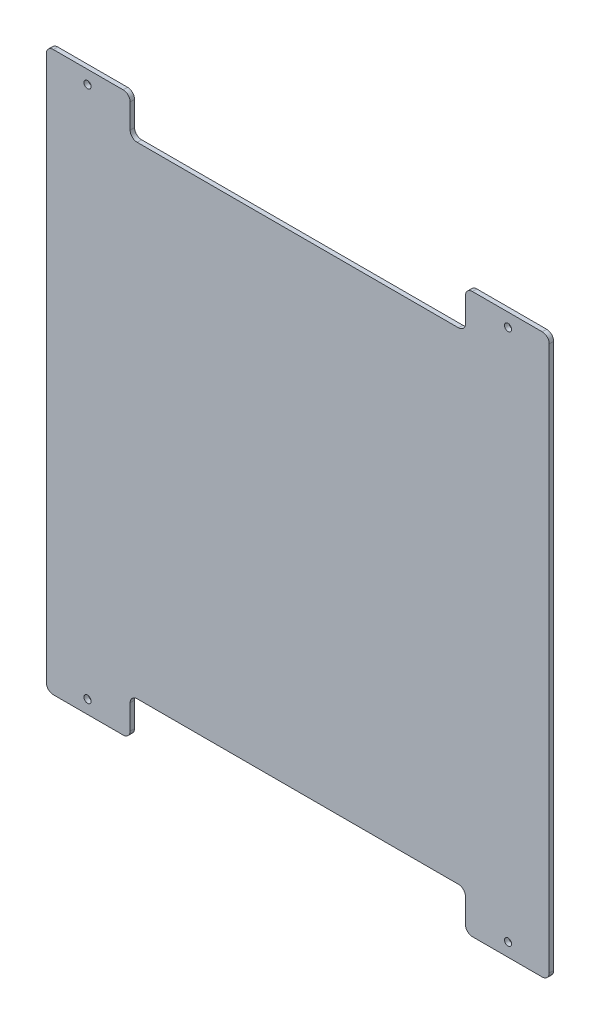
ISO-10303-21;
HEADER;
FILE_DESCRIPTION(('STEP AP214'),'2;1');
FILE_NAME('part.step','',(''),(''),'','','');
FILE_SCHEMA(('AUTOMOTIVE_DESIGN { 1 0 10303 214 1 1 1 1 }'));
ENDSEC;
DATA;
#1=APPLICATION_CONTEXT('core data for automotive mechanical design processes');
#2=APPLICATION_PROTOCOL_DEFINITION('international standard','automotive_design',2000,#1);
#3=PRODUCT_CONTEXT('',#1,'mechanical');
#4=PRODUCT('Part','Part','',(#3));
#5=PRODUCT_RELATED_PRODUCT_CATEGORY('part','',(#4));
#6=PRODUCT_DEFINITION_FORMATION('','',#4);
#7=PRODUCT_DEFINITION_CONTEXT('part definition',#1,'design');
#8=PRODUCT_DEFINITION('design','',#6,#7);
#9=PRODUCT_DEFINITION_SHAPE('','',#8);
#10=(LENGTH_UNIT() NAMED_UNIT(*) SI_UNIT(.MILLI.,.METRE.));
#11=(NAMED_UNIT(*) PLANE_ANGLE_UNIT() SI_UNIT($,.RADIAN.));
#12=(NAMED_UNIT(*) SI_UNIT($,.STERADIAN.) SOLID_ANGLE_UNIT());
#13=UNCERTAINTY_MEASURE_WITH_UNIT(LENGTH_MEASURE(1.E-05),#10,'distance_accuracy_value','');
#14=(GEOMETRIC_REPRESENTATION_CONTEXT(3) GLOBAL_UNCERTAINTY_ASSIGNED_CONTEXT((#13)) GLOBAL_UNIT_ASSIGNED_CONTEXT((#10,
#11,#12)) REPRESENTATION_CONTEXT('',''));
#15=CARTESIAN_POINT('',(0.,0.,0.));
#16=DIRECTION('',(0.,0.,1.));
#17=DIRECTION('',(1.,0.,0.));
#18=AXIS2_PLACEMENT_3D('',#15,#16,#17);
#19=CARTESIAN_POINT('',(115.,-177.5,3.175));
#20=DIRECTION('',(0.,0.,-1.));
#21=DIRECTION('',(-1.,0.,0.));
#22=AXIS2_PLACEMENT_3D('',#19,#20,#21);
#23=CYLINDRICAL_SURFACE('',#22,5.00000000000038);
#24=CARTESIAN_POINT('',(115.,-177.5,0.));
#25=DIRECTION('',(0.,0.,1.));
#26=DIRECTION('',(1.,0.,0.));
#27=AXIS2_PLACEMENT_3D('',#24,#25,#26);
#28=CIRCLE('',#27,5.00000000000038);
#29=CARTESIAN_POINT('',(120.,-177.5,0.));
#30=VERTEX_POINT('',#29);
#31=CARTESIAN_POINT('',(115.,-172.5,0.));
#32=VERTEX_POINT('',#31);
#33=EDGE_CURVE('E226',#30,#32,#28,.T.);
#34=ORIENTED_EDGE('',*,*,#33,.F.);
#35=DIRECTION('',(0.,0.,-1.));
#36=VECTOR('',#35,1.);
#37=CARTESIAN_POINT('',(120.,-177.5,3.175));
#38=LINE('',#37,#36);
#39=CARTESIAN_POINT('',(120.,-177.5,3.175));
#40=VERTEX_POINT('',#39);
#41=EDGE_CURVE('E11',#40,#30,#38,.T.);
#42=ORIENTED_EDGE('',*,*,#41,.F.);
#43=CARTESIAN_POINT('',(115.,-177.5,3.175));
#44=DIRECTION('',(0.,0.,1.));
#45=DIRECTION('',(1.,0.,0.));
#46=AXIS2_PLACEMENT_3D('',#43,#44,#45);
#47=CIRCLE('',#46,5.00000000000038);
#48=CARTESIAN_POINT('',(115.,-172.5,3.175));
#49=VERTEX_POINT('',#48);
#50=EDGE_CURVE('E290',#40,#49,#47,.T.);
#51=ORIENTED_EDGE('',*,*,#50,.T.);
#52=DIRECTION('',(0.,0.,-1.));
#53=VECTOR('',#52,1.);
#54=CARTESIAN_POINT('',(115.,-172.5,3.175));
#55=LINE('',#54,#53);
#56=EDGE_CURVE('E135',#49,#32,#55,.T.);
#57=ORIENTED_EDGE('',*,*,#56,.T.);
#58=EDGE_LOOP('',(#34,#42,#51,#57));
#59=FACE_BOUND('',#58,.T.);
#60=ADVANCED_FACE('F37',(#59),#23,.F.);
#61=CARTESIAN_POINT('',(120.,-1.90323947078601E-13,3.175));
#62=DIRECTION('',(1.,0.,0.));
#63=DIRECTION('',(0.,1.,0.));
#64=AXIS2_PLACEMENT_3D('',#61,#62,#63);
#65=PLANE('',#64);
#66=DIRECTION('',(0.,-1.,0.));
#67=VECTOR('',#66,1.);
#68=CARTESIAN_POINT('',(120.,-1.90323947078601E-13,0.));
#69=LINE('',#68,#67);
#70=CARTESIAN_POINT('',(120.,-195.,0.));
#71=VERTEX_POINT('',#70);
#72=EDGE_CURVE('E229',#30,#71,#69,.T.);
#73=ORIENTED_EDGE('',*,*,#72,.T.);
#74=DIRECTION('',(0.,0.,-1.));
#75=VECTOR('',#74,1.);
#76=CARTESIAN_POINT('',(120.,-195.,3.175));
#77=LINE('',#76,#75);
#78=CARTESIAN_POINT('',(120.,-195.,3.175));
#79=VERTEX_POINT('',#78);
#80=EDGE_CURVE('E45',#79,#71,#77,.T.);
#81=ORIENTED_EDGE('',*,*,#80,.F.);
#82=DIRECTION('',(0.,-1.,0.));
#83=VECTOR('',#82,1.);
#84=CARTESIAN_POINT('',(120.,-1.90323947078601E-13,3.175));
#85=LINE('',#84,#83);
#86=EDGE_CURVE('E357',#40,#79,#85,.T.);
#87=ORIENTED_EDGE('',*,*,#86,.F.);
#88=ORIENTED_EDGE('',*,*,#41,.T.);
#89=EDGE_LOOP('',(#73,#81,#87,#88));
#90=FACE_BOUND('',#89,.T.);
#91=ADVANCED_FACE('F462',(#90),#65,.F.);
#92=CARTESIAN_POINT('',(125.,-195.,3.175));
#93=DIRECTION('',(0.,0.,-1.));
#94=DIRECTION('',(-1.,0.,0.));
#95=AXIS2_PLACEMENT_3D('',#92,#93,#94);
#96=CYLINDRICAL_SURFACE('',#95,5.00000000000002);
#97=CARTESIAN_POINT('',(125.,-195.,0.));
#98=DIRECTION('',(0.,0.,1.));
#99=DIRECTION('',(1.,0.,0.));
#100=AXIS2_PLACEMENT_3D('',#97,#98,#99);
#101=CIRCLE('',#100,5.00000000000002);
#102=CARTESIAN_POINT('',(125.,-200.,0.));
#103=VERTEX_POINT('',#102);
#104=EDGE_CURVE('E232',#71,#103,#101,.T.);
#105=ORIENTED_EDGE('',*,*,#104,.T.);
#106=DIRECTION('',(0.,0.,-1.));
#107=VECTOR('',#106,1.);
#108=CARTESIAN_POINT('',(125.,-200.,3.175));
#109=LINE('',#108,#107);
#110=CARTESIAN_POINT('',(125.,-200.,3.175));
#111=VERTEX_POINT('',#110);
#112=EDGE_CURVE('E332',#111,#103,#109,.T.);
#113=ORIENTED_EDGE('',*,*,#112,.F.);
#114=CARTESIAN_POINT('',(125.,-195.,3.175));
#115=DIRECTION('',(0.,0.,1.));
#116=DIRECTION('',(1.,0.,0.));
#117=AXIS2_PLACEMENT_3D('',#114,#115,#116);
#118=CIRCLE('',#117,5.00000000000002);
#119=EDGE_CURVE('E340',#79,#111,#118,.T.);
#120=ORIENTED_EDGE('',*,*,#119,.F.);
#121=ORIENTED_EDGE('',*,*,#80,.T.);
#122=EDGE_LOOP('',(#105,#113,#120,#121));
#123=FACE_BOUND('',#122,.T.);
#124=ADVANCED_FACE('F338',(#123),#96,.T.);
#125=CARTESIAN_POINT('',(2.22044604925032E-13,-200.,3.175));
#126=DIRECTION('',(0.,-1.,0.));
#127=DIRECTION('',(1.,0.,0.));
#128=AXIS2_PLACEMENT_3D('',#125,#126,#127);
#129=PLANE('',#128);
#130=DIRECTION('',(-1.,0.,0.));
#131=VECTOR('',#130,1.);
#132=CARTESIAN_POINT('',(2.22044604925032E-13,-200.,0.));
#133=LINE('',#132,#131);
#134=CARTESIAN_POINT('',(175.,-200.,0.));
#135=VERTEX_POINT('',#134);
#136=EDGE_CURVE('E235',#135,#103,#133,.T.);
#137=ORIENTED_EDGE('',*,*,#136,.F.);
#138=DIRECTION('',(0.,0.,-1.));
#139=VECTOR('',#138,1.);
#140=CARTESIAN_POINT('',(175.,-200.,3.175));
#141=LINE('',#140,#139);
#142=CARTESIAN_POINT('',(175.,-200.,3.175));
#143=VERTEX_POINT('',#142);
#144=EDGE_CURVE('E330',#143,#135,#141,.T.);
#145=ORIENTED_EDGE('',*,*,#144,.F.);
#146=DIRECTION('',(-1.,0.,0.));
#147=VECTOR('',#146,1.);
#148=CARTESIAN_POINT('',(2.22044604925032E-13,-200.,3.175));
#149=LINE('',#148,#147);
#150=EDGE_CURVE('E352',#143,#111,#149,.T.);
#151=ORIENTED_EDGE('',*,*,#150,.T.);
#152=ORIENTED_EDGE('',*,*,#112,.T.);
#153=EDGE_LOOP('',(#137,#145,#151,#152));
#154=FACE_BOUND('',#153,.T.);
#155=ADVANCED_FACE('F348',(#154),#129,.T.);
#156=CARTESIAN_POINT('',(175.,-195.,3.175));
#157=DIRECTION('',(0.,0.,-1.));
#158=DIRECTION('',(-1.,0.,0.));
#159=AXIS2_PLACEMENT_3D('',#156,#157,#158);
#160=CYLINDRICAL_SURFACE('',#159,5.00000000000002);
#161=CARTESIAN_POINT('',(175.,-195.,0.));
#162=DIRECTION('',(0.,0.,1.));
#163=DIRECTION('',(1.,0.,0.));
#164=AXIS2_PLACEMENT_3D('',#161,#162,#163);
#165=CIRCLE('',#164,5.00000000000002);
#166=CARTESIAN_POINT('',(180.,-195.,0.));
#167=VERTEX_POINT('',#166);
#168=EDGE_CURVE('E238',#135,#167,#165,.T.);
#169=ORIENTED_EDGE('',*,*,#168,.T.);
#170=DIRECTION('',(0.,0.,-1.));
#171=VECTOR('',#170,1.);
#172=CARTESIAN_POINT('',(180.,-195.,3.175));
#173=LINE('',#172,#171);
#174=CARTESIAN_POINT('',(180.,-195.,3.175));
#175=VERTEX_POINT('',#174);
#176=EDGE_CURVE('E328',#175,#167,#173,.T.);
#177=ORIENTED_EDGE('',*,*,#176,.F.);
#178=CARTESIAN_POINT('',(175.,-195.,3.175));
#179=DIRECTION('',(0.,0.,1.));
#180=DIRECTION('',(1.,0.,0.));
#181=AXIS2_PLACEMENT_3D('',#178,#179,#180);
#182=CIRCLE('',#181,5.00000000000002);
#183=EDGE_CURVE('E353',#143,#175,#182,.T.);
#184=ORIENTED_EDGE('',*,*,#183,.F.);
#185=ORIENTED_EDGE('',*,*,#144,.T.);
#186=EDGE_LOOP('',(#169,#177,#184,#185));
#187=FACE_BOUND('',#186,.T.);
#188=ADVANCED_FACE('F473',(#187),#160,.T.);
#189=CARTESIAN_POINT('',(180.,0.,3.175));
#190=DIRECTION('',(1.,0.,0.));
#191=DIRECTION('',(0.,1.,0.));
#192=AXIS2_PLACEMENT_3D('',#189,#190,#191);
#193=PLANE('',#192);
#194=DIRECTION('',(0.,-1.,0.));
#195=VECTOR('',#194,1.);
#196=CARTESIAN_POINT('',(180.,0.,0.));
#197=LINE('',#196,#195);
#198=CARTESIAN_POINT('',(180.,195.,0.));
#199=VERTEX_POINT('',#198);
#200=EDGE_CURVE('E241',#199,#167,#197,.T.);
#201=ORIENTED_EDGE('',*,*,#200,.F.);
#202=DIRECTION('',(0.,0.,-1.));
#203=VECTOR('',#202,1.);
#204=CARTESIAN_POINT('',(180.,195.,3.175));
#205=LINE('',#204,#203);
#206=CARTESIAN_POINT('',(180.,195.,3.175));
#207=VERTEX_POINT('',#206);
#208=EDGE_CURVE('E326',#207,#199,#205,.T.);
#209=ORIENTED_EDGE('',*,*,#208,.F.);
#210=DIRECTION('',(0.,-1.,0.));
#211=VECTOR('',#210,1.);
#212=CARTESIAN_POINT('',(180.,0.,3.175));
#213=LINE('',#212,#211);
#214=EDGE_CURVE('E355',#207,#175,#213,.T.);
#215=ORIENTED_EDGE('',*,*,#214,.T.);
#216=ORIENTED_EDGE('',*,*,#176,.T.);
#217=EDGE_LOOP('',(#201,#209,#215,#216));
#218=FACE_BOUND('',#217,.T.);
#219=ADVANCED_FACE('F476',(#218),#193,.T.);
#220=CARTESIAN_POINT('',(175.,195.,3.175));
#221=DIRECTION('',(0.,0.,-1.));
#222=DIRECTION('',(-1.,0.,0.));
#223=AXIS2_PLACEMENT_3D('',#220,#221,#222);
#224=CYLINDRICAL_SURFACE('',#223,5.00000000000002);
#225=CARTESIAN_POINT('',(175.,195.,0.));
#226=DIRECTION('',(0.,0.,1.));
#227=DIRECTION('',(1.,0.,0.));
#228=AXIS2_PLACEMENT_3D('',#225,#226,#227);
#229=CIRCLE('',#228,5.00000000000002);
#230=CARTESIAN_POINT('',(175.,200.,0.));
#231=VERTEX_POINT('',#230);
#232=EDGE_CURVE('E244',#199,#231,#229,.T.);
#233=ORIENTED_EDGE('',*,*,#232,.T.);
#234=DIRECTION('',(0.,0.,-1.));
#235=VECTOR('',#234,1.);
#236=CARTESIAN_POINT('',(175.,200.,3.175));
#237=LINE('',#236,#235);
#238=CARTESIAN_POINT('',(175.,200.,3.175));
#239=VERTEX_POINT('',#238);
#240=EDGE_CURVE('E323',#239,#231,#237,.T.);
#241=ORIENTED_EDGE('',*,*,#240,.F.);
#242=CARTESIAN_POINT('',(175.,195.,3.175));
#243=DIRECTION('',(0.,0.,1.));
#244=DIRECTION('',(1.,0.,0.));
#245=AXIS2_PLACEMENT_3D('',#242,#243,#244);
#246=CIRCLE('',#245,5.00000000000002);
#247=EDGE_CURVE('E363',#207,#239,#246,.T.);
#248=ORIENTED_EDGE('',*,*,#247,.F.);
#249=ORIENTED_EDGE('',*,*,#208,.T.);
#250=EDGE_LOOP('',(#233,#241,#248,#249));
#251=FACE_BOUND('',#250,.T.);
#252=ADVANCED_FACE('F480',(#251),#224,.T.);
#253=CARTESIAN_POINT('',(-1.11022302462516E-13,200.,3.175));
#254=DIRECTION('',(0.,-1.,0.));
#255=DIRECTION('',(1.,0.,0.));
#256=AXIS2_PLACEMENT_3D('',#253,#254,#255);
#257=PLANE('',#256);
#258=DIRECTION('',(-1.,0.,0.));
#259=VECTOR('',#258,1.);
#260=CARTESIAN_POINT('',(-1.11022302462516E-13,200.,0.));
#261=LINE('',#260,#259);
#262=CARTESIAN_POINT('',(125.,200.,0.));
#263=VERTEX_POINT('',#262);
#264=EDGE_CURVE('E246',#231,#263,#261,.T.);
#265=ORIENTED_EDGE('',*,*,#264,.T.);
#266=DIRECTION('',(0.,0.,-1.));
#267=VECTOR('',#266,1.);
#268=CARTESIAN_POINT('',(125.,200.,3.175));
#269=LINE('',#268,#267);
#270=CARTESIAN_POINT('',(125.,200.,3.175));
#271=VERTEX_POINT('',#270);
#272=EDGE_CURVE('E321',#271,#263,#269,.T.);
#273=ORIENTED_EDGE('',*,*,#272,.F.);
#274=DIRECTION('',(-1.,0.,0.));
#275=VECTOR('',#274,1.);
#276=CARTESIAN_POINT('',(-1.11022302462516E-13,200.,3.175));
#277=LINE('',#276,#275);
#278=EDGE_CURVE('E365',#239,#271,#277,.T.);
#279=ORIENTED_EDGE('',*,*,#278,.F.);
#280=ORIENTED_EDGE('',*,*,#240,.T.);
#281=EDGE_LOOP('',(#265,#273,#279,#280));
#282=FACE_BOUND('',#281,.T.);
#283=ADVANCED_FACE('F484',(#282),#257,.F.);
#284=CARTESIAN_POINT('',(125.,195.,3.175));
#285=DIRECTION('',(0.,0.,-1.));
#286=DIRECTION('',(-1.,0.,0.));
#287=AXIS2_PLACEMENT_3D('',#284,#285,#286);
#288=CYLINDRICAL_SURFACE('',#287,5.);
#289=CARTESIAN_POINT('',(125.,195.,0.));
#290=DIRECTION('',(0.,0.,1.));
#291=DIRECTION('',(1.,0.,0.));
#292=AXIS2_PLACEMENT_3D('',#289,#290,#291);
#293=CIRCLE('',#292,5.);
#294=CARTESIAN_POINT('',(120.,195.,0.));
#295=VERTEX_POINT('',#294);
#296=EDGE_CURVE('E249',#295,#263,#293,.F.);
#297=ORIENTED_EDGE('',*,*,#296,.F.);
#298=DIRECTION('',(0.,0.,-1.));
#299=VECTOR('',#298,1.);
#300=CARTESIAN_POINT('',(120.,195.,3.175));
#301=LINE('',#300,#299);
#302=CARTESIAN_POINT('',(120.,195.,3.175));
#303=VERTEX_POINT('',#302);
#304=EDGE_CURVE('E319',#303,#295,#301,.T.);
#305=ORIENTED_EDGE('',*,*,#304,.F.);
#306=CARTESIAN_POINT('',(125.,195.,3.175));
#307=DIRECTION('',(0.,0.,1.));
#308=DIRECTION('',(1.,0.,0.));
#309=AXIS2_PLACEMENT_3D('',#306,#307,#308);
#310=CIRCLE('',#309,5.);
#311=EDGE_CURVE('E367',#303,#271,#310,.F.);
#312=ORIENTED_EDGE('',*,*,#311,.T.);
#313=ORIENTED_EDGE('',*,*,#272,.T.);
#314=EDGE_LOOP('',(#297,#305,#312,#313));
#315=FACE_BOUND('',#314,.T.);
#316=ADVANCED_FACE('F488',(#315),#288,.T.);
#317=CARTESIAN_POINT('',(120.,0.,3.175));
#318=DIRECTION('',(-1.,0.,0.));
#319=DIRECTION('',(0.,0.,1.));
#320=AXIS2_PLACEMENT_3D('',#317,#318,#319);
#321=PLANE('',#320);
#322=DIRECTION('',(0.,1.,0.));
#323=VECTOR('',#322,1.);
#324=CARTESIAN_POINT('',(120.,0.,0.));
#325=LINE('',#324,#323);
#326=CARTESIAN_POINT('',(120.,177.5,0.));
#327=VERTEX_POINT('',#326);
#328=EDGE_CURVE('E252',#327,#295,#325,.T.);
#329=ORIENTED_EDGE('',*,*,#328,.F.);
#330=DIRECTION('',(0.,0.,-1.));
#331=VECTOR('',#330,1.);
#332=CARTESIAN_POINT('',(120.,177.5,3.175));
#333=LINE('',#332,#331);
#334=CARTESIAN_POINT('',(120.,177.5,3.175));
#335=VERTEX_POINT('',#334);
#336=EDGE_CURVE('E317',#335,#327,#333,.T.);
#337=ORIENTED_EDGE('',*,*,#336,.F.);
#338=DIRECTION('',(0.,1.,0.));
#339=VECTOR('',#338,1.);
#340=CARTESIAN_POINT('',(120.,0.,3.175));
#341=LINE('',#340,#339);
#342=EDGE_CURVE('E370',#335,#303,#341,.T.);
#343=ORIENTED_EDGE('',*,*,#342,.T.);
#344=ORIENTED_EDGE('',*,*,#304,.T.);
#345=EDGE_LOOP('',(#329,#337,#343,#344));
#346=FACE_BOUND('',#345,.T.);
#347=ADVANCED_FACE('F492',(#346),#321,.T.);
#348=CARTESIAN_POINT('',(115.,177.5,3.175));
#349=DIRECTION('',(0.,0.,-1.));
#350=DIRECTION('',(-1.,0.,0.));
#351=AXIS2_PLACEMENT_3D('',#348,#349,#350);
#352=CYLINDRICAL_SURFACE('',#351,5.00000000000002);
#353=CARTESIAN_POINT('',(115.,177.5,0.));
#354=DIRECTION('',(0.,0.,1.));
#355=DIRECTION('',(1.,0.,0.));
#356=AXIS2_PLACEMENT_3D('',#353,#354,#355);
#357=CIRCLE('',#356,5.00000000000002);
#358=CARTESIAN_POINT('',(115.,172.5,0.));
#359=VERTEX_POINT('',#358);
#360=EDGE_CURVE('E255',#327,#359,#357,.F.);
#361=ORIENTED_EDGE('',*,*,#360,.T.);
#362=DIRECTION('',(0.,0.,-1.));
#363=VECTOR('',#362,1.);
#364=CARTESIAN_POINT('',(115.,172.5,3.175));
#365=LINE('',#364,#363);
#366=CARTESIAN_POINT('',(115.,172.5,3.175));
#367=VERTEX_POINT('',#366);
#368=EDGE_CURVE('E315',#367,#359,#365,.T.);
#369=ORIENTED_EDGE('',*,*,#368,.F.);
#370=CARTESIAN_POINT('',(115.,177.5,3.175));
#371=DIRECTION('',(0.,0.,1.));
#372=DIRECTION('',(1.,0.,0.));
#373=AXIS2_PLACEMENT_3D('',#370,#371,#372);
#374=CIRCLE('',#373,5.00000000000002);
#375=EDGE_CURVE('E373',#335,#367,#374,.F.);
#376=ORIENTED_EDGE('',*,*,#375,.F.);
#377=ORIENTED_EDGE('',*,*,#336,.T.);
#378=EDGE_LOOP('',(#361,#369,#376,#377));
#379=FACE_BOUND('',#378,.T.);
#380=ADVANCED_FACE('F496',(#379),#352,.F.);
#381=CARTESIAN_POINT('',(0.,172.5,3.175));
#382=DIRECTION('',(0.,1.,0.));
#383=DIRECTION('',(-1.,0.,0.));
#384=AXIS2_PLACEMENT_3D('',#381,#382,#383);
#385=PLANE('',#384);
#386=DIRECTION('',(1.,0.,0.));
#387=VECTOR('',#386,1.);
#388=CARTESIAN_POINT('',(0.,172.5,0.));
#389=LINE('',#388,#387);
#390=CARTESIAN_POINT('',(-115.,172.5,0.));
#391=VERTEX_POINT('',#390);
#392=EDGE_CURVE('E258',#391,#359,#389,.T.);
#393=ORIENTED_EDGE('',*,*,#392,.F.);
#394=DIRECTION('',(0.,0.,-1.));
#395=VECTOR('',#394,1.);
#396=CARTESIAN_POINT('',(-115.,172.5,3.175));
#397=LINE('',#396,#395);
#398=CARTESIAN_POINT('',(-115.,172.5,3.175));
#399=VERTEX_POINT('',#398);
#400=EDGE_CURVE('E313',#399,#391,#397,.T.);
#401=ORIENTED_EDGE('',*,*,#400,.F.);
#402=DIRECTION('',(1.,0.,0.));
#403=VECTOR('',#402,1.);
#404=CARTESIAN_POINT('',(0.,172.5,3.175));
#405=LINE('',#404,#403);
#406=EDGE_CURVE('E375',#399,#367,#405,.T.);
#407=ORIENTED_EDGE('',*,*,#406,.T.);
#408=ORIENTED_EDGE('',*,*,#368,.T.);
#409=EDGE_LOOP('',(#393,#401,#407,#408));
#410=FACE_BOUND('',#409,.T.);
#411=ADVANCED_FACE('F500',(#410),#385,.T.);
#412=CARTESIAN_POINT('',(-115.,177.5,3.175));
#413=DIRECTION('',(0.,0.,-1.));
#414=DIRECTION('',(-1.,0.,0.));
#415=AXIS2_PLACEMENT_3D('',#412,#413,#414);
#416=CYLINDRICAL_SURFACE('',#415,4.99999999999999);
#417=CARTESIAN_POINT('',(-115.,177.5,0.));
#418=DIRECTION('',(0.,0.,1.));
#419=DIRECTION('',(1.,0.,0.));
#420=AXIS2_PLACEMENT_3D('',#417,#418,#419);
#421=CIRCLE('',#420,4.99999999999999);
#422=CARTESIAN_POINT('',(-120.,177.5,0.));
#423=VERTEX_POINT('',#422);
#424=EDGE_CURVE('E261',#423,#391,#421,.T.);
#425=ORIENTED_EDGE('',*,*,#424,.F.);
#426=DIRECTION('',(0.,0.,-1.));
#427=VECTOR('',#426,1.);
#428=CARTESIAN_POINT('',(-120.,177.5,3.175));
#429=LINE('',#428,#427);
#430=CARTESIAN_POINT('',(-120.,177.5,3.175));
#431=VERTEX_POINT('',#430);
#432=EDGE_CURVE('E311',#431,#423,#429,.T.);
#433=ORIENTED_EDGE('',*,*,#432,.F.);
#434=CARTESIAN_POINT('',(-115.,177.5,3.175));
#435=DIRECTION('',(0.,0.,1.));
#436=DIRECTION('',(1.,0.,0.));
#437=AXIS2_PLACEMENT_3D('',#434,#435,#436);
#438=CIRCLE('',#437,4.99999999999999);
#439=EDGE_CURVE('E378',#431,#399,#438,.T.);
#440=ORIENTED_EDGE('',*,*,#439,.T.);
#441=ORIENTED_EDGE('',*,*,#400,.T.);
#442=EDGE_LOOP('',(#425,#433,#440,#441));
#443=FACE_BOUND('',#442,.T.);
#444=ADVANCED_FACE('F504',(#443),#416,.F.);
#445=CARTESIAN_POINT('',(-120.,0.,3.175));
#446=DIRECTION('',(-1.,0.,0.));
#447=DIRECTION('',(0.,0.,1.));
#448=AXIS2_PLACEMENT_3D('',#445,#446,#447);
#449=PLANE('',#448);
#450=DIRECTION('',(0.,1.,0.));
#451=VECTOR('',#450,1.);
#452=CARTESIAN_POINT('',(-120.,0.,0.));
#453=LINE('',#452,#451);
#454=CARTESIAN_POINT('',(-120.,195.,0.));
#455=VERTEX_POINT('',#454);
#456=EDGE_CURVE('E264',#423,#455,#453,.T.);
#457=ORIENTED_EDGE('',*,*,#456,.T.);
#458=DIRECTION('',(0.,0.,-1.));
#459=VECTOR('',#458,1.);
#460=CARTESIAN_POINT('',(-120.,195.,3.175));
#461=LINE('',#460,#459);
#462=CARTESIAN_POINT('',(-120.,195.,3.175));
#463=VERTEX_POINT('',#462);
#464=EDGE_CURVE('E308',#463,#455,#461,.T.);
#465=ORIENTED_EDGE('',*,*,#464,.F.);
#466=DIRECTION('',(0.,1.,0.));
#467=VECTOR('',#466,1.);
#468=CARTESIAN_POINT('',(-120.,0.,3.175));
#469=LINE('',#468,#467);
#470=EDGE_CURVE('E381',#431,#463,#469,.T.);
#471=ORIENTED_EDGE('',*,*,#470,.F.);
#472=ORIENTED_EDGE('',*,*,#432,.T.);
#473=EDGE_LOOP('',(#457,#465,#471,#472));
#474=FACE_BOUND('',#473,.T.);
#475=ADVANCED_FACE('F508',(#474),#449,.F.);
#476=CARTESIAN_POINT('',(-125.,195.,3.175));
#477=DIRECTION('',(0.,0.,-1.));
#478=DIRECTION('',(-1.,0.,0.));
#479=AXIS2_PLACEMENT_3D('',#476,#477,#478);
#480=CYLINDRICAL_SURFACE('',#479,5.00000000000001);
#481=CARTESIAN_POINT('',(-125.,195.,0.));
#482=DIRECTION('',(0.,0.,1.));
#483=DIRECTION('',(1.,0.,0.));
#484=AXIS2_PLACEMENT_3D('',#481,#482,#483);
#485=CIRCLE('',#484,5.00000000000001);
#486=CARTESIAN_POINT('',(-125.,200.,0.));
#487=VERTEX_POINT('',#486);
#488=EDGE_CURVE('E266',#455,#487,#485,.T.);
#489=ORIENTED_EDGE('',*,*,#488,.T.);
#490=DIRECTION('',(0.,0.,-1.));
#491=VECTOR('',#490,1.);
#492=CARTESIAN_POINT('',(-125.,200.,3.175));
#493=LINE('',#492,#491);
#494=CARTESIAN_POINT('',(-125.,200.,3.175));
#495=VERTEX_POINT('',#494);
#496=EDGE_CURVE('E306',#495,#487,#493,.T.);
#497=ORIENTED_EDGE('',*,*,#496,.F.);
#498=CARTESIAN_POINT('',(-125.,195.,3.175));
#499=DIRECTION('',(0.,0.,1.));
#500=DIRECTION('',(1.,0.,0.));
#501=AXIS2_PLACEMENT_3D('',#498,#499,#500);
#502=CIRCLE('',#501,5.00000000000001);
#503=EDGE_CURVE('E383',#463,#495,#502,.T.);
#504=ORIENTED_EDGE('',*,*,#503,.F.);
#505=ORIENTED_EDGE('',*,*,#464,.T.);
#506=EDGE_LOOP('',(#489,#497,#504,#505));
#507=FACE_BOUND('',#506,.T.);
#508=ADVANCED_FACE('F512',(#507),#480,.T.);
#509=CARTESIAN_POINT('',(-1.11022302462516E-13,200.,3.175));
#510=DIRECTION('',(0.,1.,0.));
#511=DIRECTION('',(-1.,0.,0.));
#512=AXIS2_PLACEMENT_3D('',#509,#510,#511);
#513=PLANE('',#512);
#514=DIRECTION('',(1.,0.,0.));
#515=VECTOR('',#514,1.);
#516=CARTESIAN_POINT('',(-1.11022302462516E-13,200.,0.));
#517=LINE('',#516,#515);
#518=CARTESIAN_POINT('',(-175.,200.,0.));
#519=VERTEX_POINT('',#518);
#520=EDGE_CURVE('E269',#519,#487,#517,.T.);
#521=ORIENTED_EDGE('',*,*,#520,.F.);
#522=DIRECTION('',(0.,0.,-1.));
#523=VECTOR('',#522,1.);
#524=CARTESIAN_POINT('',(-175.,200.,3.175));
#525=LINE('',#524,#523);
#526=CARTESIAN_POINT('',(-175.,200.,3.175));
#527=VERTEX_POINT('',#526);
#528=EDGE_CURVE('E304',#527,#519,#525,.T.);
#529=ORIENTED_EDGE('',*,*,#528,.F.);
#530=DIRECTION('',(1.,0.,0.));
#531=VECTOR('',#530,1.);
#532=CARTESIAN_POINT('',(-1.11022302462516E-13,200.,3.175));
#533=LINE('',#532,#531);
#534=EDGE_CURVE('E385',#527,#495,#533,.T.);
#535=ORIENTED_EDGE('',*,*,#534,.T.);
#536=ORIENTED_EDGE('',*,*,#496,.T.);
#537=EDGE_LOOP('',(#521,#529,#535,#536));
#538=FACE_BOUND('',#537,.T.);
#539=ADVANCED_FACE('F516',(#538),#513,.T.);
#540=CARTESIAN_POINT('',(-175.,195.,3.175));
#541=DIRECTION('',(0.,0.,-1.));
#542=DIRECTION('',(-1.,0.,0.));
#543=AXIS2_PLACEMENT_3D('',#540,#541,#542);
#544=CYLINDRICAL_SURFACE('',#543,5.00000000000002);
#545=CARTESIAN_POINT('',(-175.,195.,0.));
#546=DIRECTION('',(0.,0.,1.));
#547=DIRECTION('',(1.,0.,0.));
#548=AXIS2_PLACEMENT_3D('',#545,#546,#547);
#549=CIRCLE('',#548,5.00000000000002);
#550=CARTESIAN_POINT('',(-180.,195.,0.));
#551=VERTEX_POINT('',#550);
#552=EDGE_CURVE('E272',#519,#551,#549,.T.);
#553=ORIENTED_EDGE('',*,*,#552,.T.);
#554=DIRECTION('',(0.,0.,-1.));
#555=VECTOR('',#554,1.);
#556=CARTESIAN_POINT('',(-180.,195.,3.175));
#557=LINE('',#556,#555);
#558=CARTESIAN_POINT('',(-180.,195.,3.175));
#559=VERTEX_POINT('',#558);
#560=EDGE_CURVE('E302',#559,#551,#557,.T.);
#561=ORIENTED_EDGE('',*,*,#560,.F.);
#562=CARTESIAN_POINT('',(-175.,195.,3.175));
#563=DIRECTION('',(0.,0.,1.));
#564=DIRECTION('',(1.,0.,0.));
#565=AXIS2_PLACEMENT_3D('',#562,#563,#564);
#566=CIRCLE('',#565,5.00000000000002);
#567=EDGE_CURVE('E388',#527,#559,#566,.T.);
#568=ORIENTED_EDGE('',*,*,#567,.F.);
#569=ORIENTED_EDGE('',*,*,#528,.T.);
#570=EDGE_LOOP('',(#553,#561,#568,#569));
#571=FACE_BOUND('',#570,.T.);
#572=ADVANCED_FACE('F520',(#571),#544,.T.);
#573=CARTESIAN_POINT('',(-180.,0.,3.175));
#574=DIRECTION('',(-1.,0.,0.));
#575=DIRECTION('',(0.,-1.,0.));
#576=AXIS2_PLACEMENT_3D('',#573,#574,#575);
#577=PLANE('',#576);
#578=DIRECTION('',(0.,1.,0.));
#579=VECTOR('',#578,1.);
#580=CARTESIAN_POINT('',(-180.,0.,0.));
#581=LINE('',#580,#579);
#582=CARTESIAN_POINT('',(-180.,-195.,0.));
#583=VERTEX_POINT('',#582);
#584=EDGE_CURVE('E275',#583,#551,#581,.T.);
#585=ORIENTED_EDGE('',*,*,#584,.F.);
#586=DIRECTION('',(0.,0.,-1.));
#587=VECTOR('',#586,1.);
#588=CARTESIAN_POINT('',(-180.,-195.,3.175));
#589=LINE('',#588,#587);
#590=CARTESIAN_POINT('',(-180.,-195.,3.175));
#591=VERTEX_POINT('',#590);
#592=EDGE_CURVE('E300',#591,#583,#589,.T.);
#593=ORIENTED_EDGE('',*,*,#592,.F.);
#594=DIRECTION('',(0.,1.,0.));
#595=VECTOR('',#594,1.);
#596=CARTESIAN_POINT('',(-180.,0.,3.175));
#597=LINE('',#596,#595);
#598=EDGE_CURVE('E390',#591,#559,#597,.T.);
#599=ORIENTED_EDGE('',*,*,#598,.T.);
#600=ORIENTED_EDGE('',*,*,#560,.T.);
#601=EDGE_LOOP('',(#585,#593,#599,#600));
#602=FACE_BOUND('',#601,.T.);
#603=ADVANCED_FACE('F524',(#602),#577,.T.);
#604=CARTESIAN_POINT('',(-175.,-195.,3.175));
#605=DIRECTION('',(0.,0.,-1.));
#606=DIRECTION('',(-1.,0.,0.));
#607=AXIS2_PLACEMENT_3D('',#604,#605,#606);
#608=CYLINDRICAL_SURFACE('',#607,4.99999999999982);
#609=CARTESIAN_POINT('',(-175.,-195.,0.));
#610=DIRECTION('',(0.,0.,1.));
#611=DIRECTION('',(1.,0.,0.));
#612=AXIS2_PLACEMENT_3D('',#609,#610,#611);
#613=CIRCLE('',#612,4.99999999999982);
#614=CARTESIAN_POINT('',(-175.,-200.,0.));
#615=VERTEX_POINT('',#614);
#616=EDGE_CURVE('E278',#583,#615,#613,.T.);
#617=ORIENTED_EDGE('',*,*,#616,.T.);
#618=DIRECTION('',(0.,0.,-1.));
#619=VECTOR('',#618,1.);
#620=CARTESIAN_POINT('',(-175.,-200.,3.175));
#621=LINE('',#620,#619);
#622=CARTESIAN_POINT('',(-175.,-200.,3.175));
#623=VERTEX_POINT('',#622);
#624=EDGE_CURVE('E297',#623,#615,#621,.T.);
#625=ORIENTED_EDGE('',*,*,#624,.F.);
#626=CARTESIAN_POINT('',(-175.,-195.,3.175));
#627=DIRECTION('',(0.,0.,1.));
#628=DIRECTION('',(1.,0.,0.));
#629=AXIS2_PLACEMENT_3D('',#626,#627,#628);
#630=CIRCLE('',#629,4.99999999999982);
#631=EDGE_CURVE('E393',#591,#623,#630,.T.);
#632=ORIENTED_EDGE('',*,*,#631,.F.);
#633=ORIENTED_EDGE('',*,*,#592,.T.);
#634=EDGE_LOOP('',(#617,#625,#632,#633));
#635=FACE_BOUND('',#634,.T.);
#636=ADVANCED_FACE('F528',(#635),#608,.T.);
#637=CARTESIAN_POINT('',(-1.11022302462514E-13,-200.,3.175));
#638=DIRECTION('',(0.,1.,0.));
#639=DIRECTION('',(-1.,0.,0.));
#640=AXIS2_PLACEMENT_3D('',#637,#638,#639);
#641=PLANE('',#640);
#642=DIRECTION('',(1.,0.,0.));
#643=VECTOR('',#642,1.);
#644=CARTESIAN_POINT('',(-1.11022302462514E-13,-200.,0.));
#645=LINE('',#644,#643);
#646=CARTESIAN_POINT('',(-124.999999999999,-200.,0.));
#647=VERTEX_POINT('',#646);
#648=EDGE_CURVE('E280',#615,#647,#645,.T.);
#649=ORIENTED_EDGE('',*,*,#648,.T.);
#650=DIRECTION('',(0.,0.,-1.));
#651=VECTOR('',#650,1.);
#652=CARTESIAN_POINT('',(-124.999999999999,-200.,3.175));
#653=LINE('',#652,#651);
#654=CARTESIAN_POINT('',(-124.999999999999,-200.,3.175));
#655=VERTEX_POINT('',#654);
#656=EDGE_CURVE('E294',#655,#647,#653,.T.);
#657=ORIENTED_EDGE('',*,*,#656,.F.);
#658=DIRECTION('',(1.,0.,0.));
#659=VECTOR('',#658,1.);
#660=CARTESIAN_POINT('',(-1.11022302462514E-13,-200.,3.175));
#661=LINE('',#660,#659);
#662=EDGE_CURVE('E395',#623,#655,#661,.T.);
#663=ORIENTED_EDGE('',*,*,#662,.F.);
#664=ORIENTED_EDGE('',*,*,#624,.T.);
#665=EDGE_LOOP('',(#649,#657,#663,#664));
#666=FACE_BOUND('',#665,.T.);
#667=ADVANCED_FACE('F402',(#666),#641,.F.);
#668=CARTESIAN_POINT('',(-124.999999999999,-195.000000000001,3.175));
#669=DIRECTION('',(0.,0.,-1.));
#670=DIRECTION('',(-1.,0.,0.));
#671=AXIS2_PLACEMENT_3D('',#668,#669,#670);
#672=CYLINDRICAL_SURFACE('',#671,4.99999999999925);
#673=CARTESIAN_POINT('',(-124.999999999999,-195.000000000001,0.));
#674=DIRECTION('',(0.,0.,1.));
#675=DIRECTION('',(1.,0.,0.));
#676=AXIS2_PLACEMENT_3D('',#673,#674,#675);
#677=CIRCLE('',#676,4.99999999999925);
#678=CARTESIAN_POINT('',(-120.,-195.000000000001,0.));
#679=VERTEX_POINT('',#678);
#680=EDGE_CURVE('E282',#647,#679,#677,.T.);
#681=ORIENTED_EDGE('',*,*,#680,.T.);
#682=DIRECTION('',(0.,0.,-1.));
#683=VECTOR('',#682,1.);
#684=CARTESIAN_POINT('',(-120.,-195.000000000001,3.175));
#685=LINE('',#684,#683);
#686=CARTESIAN_POINT('',(-120.,-195.000000000001,3.175));
#687=VERTEX_POINT('',#686);
#688=EDGE_CURVE('E213',#687,#679,#685,.T.);
#689=ORIENTED_EDGE('',*,*,#688,.F.);
#690=CARTESIAN_POINT('',(-124.999999999999,-195.000000000001,3.175));
#691=DIRECTION('',(0.,0.,1.));
#692=DIRECTION('',(1.,0.,0.));
#693=AXIS2_PLACEMENT_3D('',#690,#691,#692);
#694=CIRCLE('',#693,4.99999999999925);
#695=EDGE_CURVE('E218',#655,#687,#694,.T.);
#696=ORIENTED_EDGE('',*,*,#695,.F.);
#697=ORIENTED_EDGE('',*,*,#656,.T.);
#698=EDGE_LOOP('',(#681,#689,#696,#697));
#699=FACE_BOUND('',#698,.T.);
#700=ADVANCED_FACE('F406',(#699),#672,.T.);
#701=CARTESIAN_POINT('',(-120.,0.,3.175));
#702=DIRECTION('',(1.,0.,0.));
#703=DIRECTION('',(0.,0.,-1.));
#704=AXIS2_PLACEMENT_3D('',#701,#702,#703);
#705=PLANE('',#704);
#706=DIRECTION('',(0.,-1.,0.));
#707=VECTOR('',#706,1.);
#708=CARTESIAN_POINT('',(-120.,0.,0.));
#709=LINE('',#708,#707);
#710=CARTESIAN_POINT('',(-120.,-177.5,0.));
#711=VERTEX_POINT('',#710);
#712=EDGE_CURVE('E208',#711,#679,#709,.T.);
#713=ORIENTED_EDGE('',*,*,#712,.F.);
#714=DIRECTION('',(0.,0.,-1.));
#715=VECTOR('',#714,1.);
#716=CARTESIAN_POINT('',(-120.,-177.5,3.175));
#717=LINE('',#716,#715);
#718=CARTESIAN_POINT('',(-120.,-177.5,3.175));
#719=VERTEX_POINT('',#718);
#720=EDGE_CURVE('E203',#719,#711,#717,.T.);
#721=ORIENTED_EDGE('',*,*,#720,.F.);
#722=DIRECTION('',(0.,-1.,0.));
#723=VECTOR('',#722,1.);
#724=CARTESIAN_POINT('',(-120.,0.,3.175));
#725=LINE('',#724,#723);
#726=EDGE_CURVE('E206',#719,#687,#725,.T.);
#727=ORIENTED_EDGE('',*,*,#726,.T.);
#728=ORIENTED_EDGE('',*,*,#688,.T.);
#729=EDGE_LOOP('',(#713,#721,#727,#728));
#730=FACE_BOUND('',#729,.T.);
#731=ADVANCED_FACE('F205',(#730),#705,.T.);
#732=CARTESIAN_POINT('',(-115.,-177.5,3.175));
#733=DIRECTION('',(0.,0.,-1.));
#734=DIRECTION('',(-1.,0.,0.));
#735=AXIS2_PLACEMENT_3D('',#732,#733,#734);
#736=CYLINDRICAL_SURFACE('',#735,5.00000000000011);
#737=CARTESIAN_POINT('',(-115.,-177.5,0.));
#738=DIRECTION('',(0.,0.,1.));
#739=DIRECTION('',(1.,0.,0.));
#740=AXIS2_PLACEMENT_3D('',#737,#738,#739);
#741=CIRCLE('',#740,5.00000000000011);
#742=CARTESIAN_POINT('',(-115.,-172.5,0.));
#743=VERTEX_POINT('',#742);
#744=EDGE_CURVE('E286',#743,#711,#741,.T.);
#745=ORIENTED_EDGE('',*,*,#744,.F.);
#746=DIRECTION('',(0.,0.,-1.));
#747=VECTOR('',#746,1.);
#748=CARTESIAN_POINT('',(-115.,-172.5,3.175));
#749=LINE('',#748,#747);
#750=CARTESIAN_POINT('',(-115.,-172.5,3.175));
#751=VERTEX_POINT('',#750);
#752=EDGE_CURVE('E128',#751,#743,#749,.T.);
#753=ORIENTED_EDGE('',*,*,#752,.F.);
#754=CARTESIAN_POINT('',(-115.,-177.5,3.175));
#755=DIRECTION('',(0.,0.,1.));
#756=DIRECTION('',(1.,0.,0.));
#757=AXIS2_PLACEMENT_3D('',#754,#755,#756);
#758=CIRCLE('',#757,5.00000000000011);
#759=EDGE_CURVE('E216',#751,#719,#758,.T.);
#760=ORIENTED_EDGE('',*,*,#759,.T.);
#761=ORIENTED_EDGE('',*,*,#720,.T.);
#762=EDGE_LOOP('',(#745,#753,#760,#761));
#763=FACE_BOUND('',#762,.T.);
#764=ADVANCED_FACE('F221',(#763),#736,.F.);
#765=CARTESIAN_POINT('',(0.,-172.5,3.175));
#766=DIRECTION('',(0.,1.,0.));
#767=DIRECTION('',(-1.,0.,0.));
#768=AXIS2_PLACEMENT_3D('',#765,#766,#767);
#769=PLANE('',#768);
#770=DIRECTION('',(1.,0.,0.));
#771=VECTOR('',#770,1.);
#772=CARTESIAN_POINT('',(0.,-172.5,0.));
#773=LINE('',#772,#771);
#774=EDGE_CURVE('E288',#743,#32,#773,.T.);
#775=ORIENTED_EDGE('',*,*,#774,.T.);
#776=ORIENTED_EDGE('',*,*,#56,.F.);
#777=DIRECTION('',(1.,0.,0.));
#778=VECTOR('',#777,1.);
#779=CARTESIAN_POINT('',(0.,-172.5,3.175));
#780=LINE('',#779,#778);
#781=EDGE_CURVE('E53',#751,#49,#780,.T.);
#782=ORIENTED_EDGE('',*,*,#781,.F.);
#783=ORIENTED_EDGE('',*,*,#752,.T.);
#784=EDGE_LOOP('',(#775,#776,#782,#783));
#785=FACE_BOUND('',#784,.T.);
#786=ADVANCED_FACE('F407',(#785),#769,.F.);
#787=CARTESIAN_POINT('',(0.,0.,3.175));
#788=DIRECTION('',(0.,0.,1.));
#789=DIRECTION('',(1.,0.,0.));
#790=AXIS2_PLACEMENT_3D('',#787,#788,#789);
#791=PLANE('',#790);
#792=CARTESIAN_POINT('',(150.499999999982,190.500000000004,3.175));
#793=DIRECTION('',(0.,0.,1.));
#794=DIRECTION('',(1.,0.,0.));
#795=AXIS2_PLACEMENT_3D('',#792,#793,#794);
#796=CIRCLE('',#795,2.54999999999999);
#797=CARTESIAN_POINT('',(153.049999999982,190.500000000004,3.175));
#798=VERTEX_POINT('',#797);
#799=EDGE_CURVE('E430',#798,#798,#796,.T.);
#800=ORIENTED_EDGE('',*,*,#799,.F.);
#801=EDGE_LOOP('',(#800));
#802=FACE_BOUND('',#801,.T.);
#803=CARTESIAN_POINT('',(150.499999999986,-190.499999999995,3.175));
#804=DIRECTION('',(0.,0.,1.));
#805=DIRECTION('',(1.,0.,0.));
#806=AXIS2_PLACEMENT_3D('',#803,#804,#805);
#807=CIRCLE('',#806,2.54999999999999);
#808=CARTESIAN_POINT('',(153.049999999986,-190.499999999995,3.175));
#809=VERTEX_POINT('',#808);
#810=EDGE_CURVE('E424',#809,#809,#807,.T.);
#811=ORIENTED_EDGE('',*,*,#810,.F.);
#812=EDGE_LOOP('',(#811));
#813=FACE_BOUND('',#812,.T.);
#814=CARTESIAN_POINT('',(-150.500000000014,-190.5,3.175));
#815=DIRECTION('',(0.,0.,1.));
#816=DIRECTION('',(1.,0.,0.));
#817=AXIS2_PLACEMENT_3D('',#814,#815,#816);
#818=CIRCLE('',#817,2.54999999999999);
#819=CARTESIAN_POINT('',(-147.950000000014,-190.5,3.175));
#820=VERTEX_POINT('',#819);
#821=EDGE_CURVE('E418',#820,#820,#818,.T.);
#822=ORIENTED_EDGE('',*,*,#821,.F.);
#823=EDGE_LOOP('',(#822));
#824=FACE_BOUND('',#823,.T.);
#825=CARTESIAN_POINT('',(-150.500000000018,190.5,3.175));
#826=DIRECTION('',(0.,0.,1.));
#827=DIRECTION('',(1.,0.,0.));
#828=AXIS2_PLACEMENT_3D('',#825,#826,#827);
#829=CIRCLE('',#828,2.54999999999999);
#830=CARTESIAN_POINT('',(-147.950000000018,190.5,3.175));
#831=VERTEX_POINT('',#830);
#832=EDGE_CURVE('E412',#831,#831,#829,.T.);
#833=ORIENTED_EDGE('',*,*,#832,.F.);
#834=EDGE_LOOP('',(#833));
#835=FACE_BOUND('',#834,.T.);
#836=ORIENTED_EDGE('',*,*,#50,.F.);
#837=ORIENTED_EDGE('',*,*,#86,.T.);
#838=ORIENTED_EDGE('',*,*,#119,.T.);
#839=ORIENTED_EDGE('',*,*,#150,.F.);
#840=ORIENTED_EDGE('',*,*,#183,.T.);
#841=ORIENTED_EDGE('',*,*,#214,.F.);
#842=ORIENTED_EDGE('',*,*,#247,.T.);
#843=ORIENTED_EDGE('',*,*,#278,.T.);
#844=ORIENTED_EDGE('',*,*,#311,.F.);
#845=ORIENTED_EDGE('',*,*,#342,.F.);
#846=ORIENTED_EDGE('',*,*,#375,.T.);
#847=ORIENTED_EDGE('',*,*,#406,.F.);
#848=ORIENTED_EDGE('',*,*,#439,.F.);
#849=ORIENTED_EDGE('',*,*,#470,.T.);
#850=ORIENTED_EDGE('',*,*,#503,.T.);
#851=ORIENTED_EDGE('',*,*,#534,.F.);
#852=ORIENTED_EDGE('',*,*,#567,.T.);
#853=ORIENTED_EDGE('',*,*,#598,.F.);
#854=ORIENTED_EDGE('',*,*,#631,.T.);
#855=ORIENTED_EDGE('',*,*,#662,.T.);
#856=ORIENTED_EDGE('',*,*,#695,.T.);
#857=ORIENTED_EDGE('',*,*,#726,.F.);
#858=ORIENTED_EDGE('',*,*,#759,.F.);
#859=ORIENTED_EDGE('',*,*,#781,.T.);
#860=EDGE_LOOP('',(#836,#837,#838,#839,#840,#841,#842,#843,#844,#845,#846,#847,#848,#849,#850,
#851,#852,#853,#854,#855,#856,#857,#858,#859));
#861=FACE_BOUND('',#860,.T.);
#862=ADVANCED_FACE('F215',(#802,#813,#824,#835,#861),#791,.T.);
#863=CARTESIAN_POINT('',(0.,0.,0.));
#864=DIRECTION('',(0.,0.,1.));
#865=DIRECTION('',(1.,0.,0.));
#866=AXIS2_PLACEMENT_3D('',#863,#864,#865);
#867=PLANE('',#866);
#868=CARTESIAN_POINT('',(150.499999999982,190.500000000004,0.));
#869=DIRECTION('',(0.,0.,1.));
#870=DIRECTION('',(1.,0.,0.));
#871=AXIS2_PLACEMENT_3D('',#868,#869,#870);
#872=CIRCLE('',#871,2.54999999999999);
#873=CARTESIAN_POINT('',(153.049999999982,190.500000000004,0.));
#874=VERTEX_POINT('',#873);
#875=EDGE_CURVE('E427',#874,#874,#872,.F.);
#876=ORIENTED_EDGE('',*,*,#875,.F.);
#877=EDGE_LOOP('',(#876));
#878=FACE_BOUND('',#877,.T.);
#879=CARTESIAN_POINT('',(150.499999999986,-190.499999999995,0.));
#880=DIRECTION('',(0.,0.,1.));
#881=DIRECTION('',(1.,0.,0.));
#882=AXIS2_PLACEMENT_3D('',#879,#880,#881);
#883=CIRCLE('',#882,2.54999999999999);
#884=CARTESIAN_POINT('',(153.049999999986,-190.499999999995,0.));
#885=VERTEX_POINT('',#884);
#886=EDGE_CURVE('E421',#885,#885,#883,.F.);
#887=ORIENTED_EDGE('',*,*,#886,.F.);
#888=EDGE_LOOP('',(#887));
#889=FACE_BOUND('',#888,.T.);
#890=CARTESIAN_POINT('',(-150.500000000014,-190.5,0.));
#891=DIRECTION('',(0.,0.,1.));
#892=DIRECTION('',(1.,0.,0.));
#893=AXIS2_PLACEMENT_3D('',#890,#891,#892);
#894=CIRCLE('',#893,2.54999999999999);
#895=CARTESIAN_POINT('',(-147.950000000014,-190.5,0.));
#896=VERTEX_POINT('',#895);
#897=EDGE_CURVE('E415',#896,#896,#894,.F.);
#898=ORIENTED_EDGE('',*,*,#897,.F.);
#899=EDGE_LOOP('',(#898));
#900=FACE_BOUND('',#899,.T.);
#901=CARTESIAN_POINT('',(-150.500000000018,190.5,0.));
#902=DIRECTION('',(0.,0.,1.));
#903=DIRECTION('',(1.,0.,0.));
#904=AXIS2_PLACEMENT_3D('',#901,#902,#903);
#905=CIRCLE('',#904,2.54999999999999);
#906=CARTESIAN_POINT('',(-147.950000000018,190.5,0.));
#907=VERTEX_POINT('',#906);
#908=EDGE_CURVE('E230',#907,#907,#905,.F.);
#909=ORIENTED_EDGE('',*,*,#908,.F.);
#910=EDGE_LOOP('',(#909));
#911=FACE_BOUND('',#910,.T.);
#912=ORIENTED_EDGE('',*,*,#33,.T.);
#913=ORIENTED_EDGE('',*,*,#774,.F.);
#914=ORIENTED_EDGE('',*,*,#744,.T.);
#915=ORIENTED_EDGE('',*,*,#712,.T.);
#916=ORIENTED_EDGE('',*,*,#680,.F.);
#917=ORIENTED_EDGE('',*,*,#648,.F.);
#918=ORIENTED_EDGE('',*,*,#616,.F.);
#919=ORIENTED_EDGE('',*,*,#584,.T.);
#920=ORIENTED_EDGE('',*,*,#552,.F.);
#921=ORIENTED_EDGE('',*,*,#520,.T.);
#922=ORIENTED_EDGE('',*,*,#488,.F.);
#923=ORIENTED_EDGE('',*,*,#456,.F.);
#924=ORIENTED_EDGE('',*,*,#424,.T.);
#925=ORIENTED_EDGE('',*,*,#392,.T.);
#926=ORIENTED_EDGE('',*,*,#360,.F.);
#927=ORIENTED_EDGE('',*,*,#328,.T.);
#928=ORIENTED_EDGE('',*,*,#296,.T.);
#929=ORIENTED_EDGE('',*,*,#264,.F.);
#930=ORIENTED_EDGE('',*,*,#232,.F.);
#931=ORIENTED_EDGE('',*,*,#200,.T.);
#932=ORIENTED_EDGE('',*,*,#168,.F.);
#933=ORIENTED_EDGE('',*,*,#136,.T.);
#934=ORIENTED_EDGE('',*,*,#104,.F.);
#935=ORIENTED_EDGE('',*,*,#72,.F.);
#936=EDGE_LOOP('',(#912,#913,#914,#915,#916,#917,#918,#919,#920,#921,#922,#923,#924,#925,#926,
#927,#928,#929,#930,#931,#932,#933,#934,#935));
#937=FACE_BOUND('',#936,.T.);
#938=ADVANCED_FACE('F344',(#878,#889,#900,#911,#937),#867,.F.);
#939=CARTESIAN_POINT('',(-150.500000000018,190.5,-0.00100000000000013));
#940=DIRECTION('',(0.,0.,1.));
#941=DIRECTION('',(1.,0.,0.));
#942=AXIS2_PLACEMENT_3D('',#939,#940,#941);
#943=CYLINDRICAL_SURFACE('',#942,2.54999999999999);
#944=ORIENTED_EDGE('',*,*,#832,.T.);
#945=EDGE_LOOP('',(#944));
#946=FACE_BOUND('',#945,.T.);
#947=ORIENTED_EDGE('',*,*,#908,.T.);
#948=EDGE_LOOP('',(#947));
#949=FACE_BOUND('',#948,.T.);
#950=ADVANCED_FACE('F446',(#946,#949),#943,.F.);
#951=CARTESIAN_POINT('',(-150.500000000014,-190.5,-0.00100000000000013));
#952=DIRECTION('',(0.,0.,1.));
#953=DIRECTION('',(1.,0.,0.));
#954=AXIS2_PLACEMENT_3D('',#951,#952,#953);
#955=CYLINDRICAL_SURFACE('',#954,2.54999999999999);
#956=ORIENTED_EDGE('',*,*,#821,.T.);
#957=EDGE_LOOP('',(#956));
#958=FACE_BOUND('',#957,.T.);
#959=ORIENTED_EDGE('',*,*,#897,.T.);
#960=EDGE_LOOP('',(#959));
#961=FACE_BOUND('',#960,.T.);
#962=ADVANCED_FACE('F449',(#958,#961),#955,.F.);
#963=CARTESIAN_POINT('',(150.499999999986,-190.499999999995,-0.00100000000000013));
#964=DIRECTION('',(0.,0.,1.));
#965=DIRECTION('',(1.,0.,0.));
#966=AXIS2_PLACEMENT_3D('',#963,#964,#965);
#967=CYLINDRICAL_SURFACE('',#966,2.54999999999999);
#968=ORIENTED_EDGE('',*,*,#810,.T.);
#969=EDGE_LOOP('',(#968));
#970=FACE_BOUND('',#969,.T.);
#971=ORIENTED_EDGE('',*,*,#886,.T.);
#972=EDGE_LOOP('',(#971));
#973=FACE_BOUND('',#972,.T.);
#974=ADVANCED_FACE('F568',(#970,#973),#967,.F.);
#975=CARTESIAN_POINT('',(150.499999999982,190.500000000004,-0.00100000000000013));
#976=DIRECTION('',(0.,0.,1.));
#977=DIRECTION('',(1.,0.,0.));
#978=AXIS2_PLACEMENT_3D('',#975,#976,#977);
#979=CYLINDRICAL_SURFACE('',#978,2.54999999999999);
#980=ORIENTED_EDGE('',*,*,#799,.T.);
#981=EDGE_LOOP('',(#980));
#982=FACE_BOUND('',#981,.T.);
#983=ORIENTED_EDGE('',*,*,#875,.T.);
#984=EDGE_LOOP('',(#983));
#985=FACE_BOUND('',#984,.T.);
#986=ADVANCED_FACE('F434',(#982,#985),#979,.F.);
#987=CLOSED_SHELL('',(#60,#91,#124,#155,#188,#219,#252,#283,#316,#347,#380,#411,#444,#475,#508,
#539,#572,#603,#636,#667,#700,#731,#764,#786,#862,#938,#950,#962,#974,#986));
#988=MANIFOLD_SOLID_BREP('B2',#987);
#989=ADVANCED_BREP_SHAPE_REPRESENTATION('',(#18,#988),#14);
#990=SHAPE_DEFINITION_REPRESENTATION(#9,#989);
ENDSEC;
END-ISO-10303-21;
